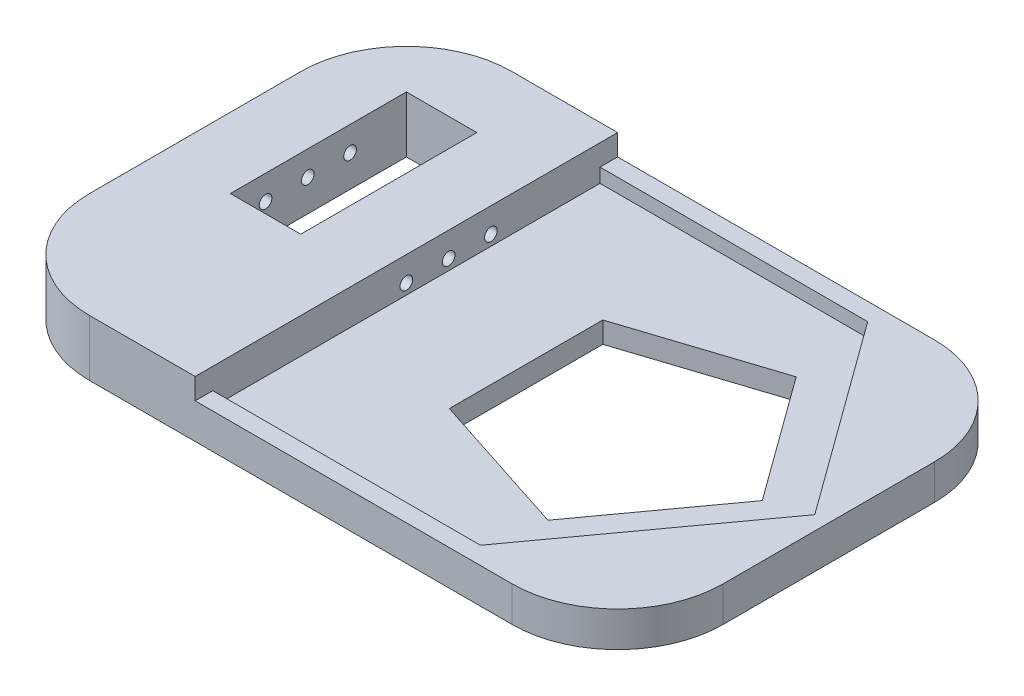
ISO-10303-21;
HEADER;
FILE_DESCRIPTION(('STEP AP214'),'2;1');
FILE_NAME('part.step','',(''),(''),'','','');
FILE_SCHEMA(('AUTOMOTIVE_DESIGN { 1 0 10303 214 1 1 1 1 }'));
ENDSEC;
DATA;
#1=APPLICATION_CONTEXT('core data for automotive mechanical design processes');
#2=APPLICATION_PROTOCOL_DEFINITION('international standard','automotive_design',2000,#1);
#3=PRODUCT_CONTEXT('',#1,'mechanical');
#4=PRODUCT('Part','Part','',(#3));
#5=PRODUCT_RELATED_PRODUCT_CATEGORY('part','',(#4));
#6=PRODUCT_DEFINITION_FORMATION('','',#4);
#7=PRODUCT_DEFINITION_CONTEXT('part definition',#1,'design');
#8=PRODUCT_DEFINITION('design','',#6,#7);
#9=PRODUCT_DEFINITION_SHAPE('','',#8);
#10=(LENGTH_UNIT() NAMED_UNIT(*) SI_UNIT(.MILLI.,.METRE.));
#11=(NAMED_UNIT(*) PLANE_ANGLE_UNIT() SI_UNIT($,.RADIAN.));
#12=(NAMED_UNIT(*) SI_UNIT($,.STERADIAN.) SOLID_ANGLE_UNIT());
#13=UNCERTAINTY_MEASURE_WITH_UNIT(LENGTH_MEASURE(1.E-05),#10,'distance_accuracy_value','');
#14=(GEOMETRIC_REPRESENTATION_CONTEXT(3) GLOBAL_UNCERTAINTY_ASSIGNED_CONTEXT((#13)) GLOBAL_UNIT_ASSIGNED_CONTEXT((#10,
#11,#12)) REPRESENTATION_CONTEXT('',''));
#15=CARTESIAN_POINT('',(0.,0.,0.));
#16=DIRECTION('',(0.,0.,1.));
#17=DIRECTION('',(1.,0.,0.));
#18=AXIS2_PLACEMENT_3D('',#15,#16,#17);
#19=CARTESIAN_POINT('',(45.,-3.,-30.));
#20=DIRECTION('',(1.,0.,0.));
#21=DIRECTION('',(0.,0.,-1.));
#22=AXIS2_PLACEMENT_3D('',#19,#20,#21);
#23=PLANE('',#22);
#24=DIRECTION('',(0.,0.,-1.));
#25=VECTOR('',#24,1.);
#26=CARTESIAN_POINT('',(45.,2.,-30.));
#27=LINE('',#26,#25);
#28=CARTESIAN_POINT('',(45.,2.,15.));
#29=VERTEX_POINT('',#28);
#30=CARTESIAN_POINT('',(45.,2.,-15.));
#31=VERTEX_POINT('',#30);
#32=EDGE_CURVE('E367',#29,#31,#27,.T.);
#33=ORIENTED_EDGE('',*,*,#32,.F.);
#34=DIRECTION('',(0.,1.,0.));
#35=VECTOR('',#34,1.);
#36=CARTESIAN_POINT('',(45.,-3.,15.));
#37=LINE('',#36,#35);
#38=CARTESIAN_POINT('',(45.,-3.,15.));
#39=VERTEX_POINT('',#38);
#40=EDGE_CURVE('E11',#29,#39,#37,.F.);
#41=ORIENTED_EDGE('',*,*,#40,.T.);
#42=DIRECTION('',(0.,0.,-1.));
#43=VECTOR('',#42,1.);
#44=CARTESIAN_POINT('',(45.,-3.,-30.));
#45=LINE('',#44,#43);
#46=CARTESIAN_POINT('',(45.,-3.,-15.));
#47=VERTEX_POINT('',#46);
#48=EDGE_CURVE('E366',#39,#47,#45,.T.);
#49=ORIENTED_EDGE('',*,*,#48,.T.);
#50=DIRECTION('',(0.,1.,0.));
#51=VECTOR('',#50,1.);
#52=CARTESIAN_POINT('',(45.,-3.,-15.));
#53=LINE('',#52,#51);
#54=EDGE_CURVE('E41',#47,#31,#53,.T.);
#55=ORIENTED_EDGE('',*,*,#54,.T.);
#56=EDGE_LOOP('',(#33,#41,#49,#55));
#57=FACE_BOUND('',#56,.T.);
#58=ADVANCED_FACE('F33',(#57),#23,.T.);
#59=CARTESIAN_POINT('',(-45.,-3.,30.));
#60=DIRECTION('',(0.,0.,1.));
#61=DIRECTION('',(1.,0.,0.));
#62=AXIS2_PLACEMENT_3D('',#59,#60,#61);
#63=PLANE('',#62);
#64=DIRECTION('',(1.,0.,0.));
#65=VECTOR('',#64,1.);
#66=CARTESIAN_POINT('',(-45.,5.,30.));
#67=LINE('',#66,#65);
#68=CARTESIAN_POINT('',(-30.,5.,30.));
#69=VERTEX_POINT('',#68);
#70=CARTESIAN_POINT('',(-15.,5.,30.));
#71=VERTEX_POINT('',#70);
#72=EDGE_CURVE('E305',#69,#71,#67,.T.);
#73=ORIENTED_EDGE('',*,*,#72,.F.);
#74=DIRECTION('',(0.,1.,0.));
#75=VECTOR('',#74,1.);
#76=CARTESIAN_POINT('',(-30.,-3.,30.));
#77=LINE('',#76,#75);
#78=CARTESIAN_POINT('',(-30.,-3.,30.));
#79=VERTEX_POINT('',#78);
#80=EDGE_CURVE('E390',#69,#79,#77,.F.);
#81=ORIENTED_EDGE('',*,*,#80,.T.);
#82=DIRECTION('',(1.,0.,0.));
#83=VECTOR('',#82,1.);
#84=CARTESIAN_POINT('',(-45.,-3.,30.));
#85=LINE('',#84,#83);
#86=CARTESIAN_POINT('',(29.9999999999999,-3.,30.));
#87=VERTEX_POINT('',#86);
#88=EDGE_CURVE('E323',#79,#87,#85,.T.);
#89=ORIENTED_EDGE('',*,*,#88,.T.);
#90=DIRECTION('',(0.,1.,0.));
#91=VECTOR('',#90,1.);
#92=CARTESIAN_POINT('',(30.,-3.,30.));
#93=LINE('',#92,#91);
#94=CARTESIAN_POINT('',(30.,2.,30.));
#95=VERTEX_POINT('',#94);
#96=EDGE_CURVE('E387',#87,#95,#93,.T.);
#97=ORIENTED_EDGE('',*,*,#96,.T.);
#98=DIRECTION('',(1.,0.,0.));
#99=VECTOR('',#98,1.);
#100=CARTESIAN_POINT('',(45.,2.,30.));
#101=LINE('',#100,#99);
#102=CARTESIAN_POINT('',(-15.,2.,30.));
#103=VERTEX_POINT('',#102);
#104=EDGE_CURVE('E324',#103,#95,#101,.T.);
#105=ORIENTED_EDGE('',*,*,#104,.F.);
#106=DIRECTION('',(0.,-1.,0.));
#107=VECTOR('',#106,1.);
#108=CARTESIAN_POINT('',(-15.,5.,30.));
#109=LINE('',#108,#107);
#110=EDGE_CURVE('E329',#71,#103,#109,.T.);
#111=ORIENTED_EDGE('',*,*,#110,.F.);
#112=EDGE_LOOP('',(#73,#81,#89,#97,#105,#111));
#113=FACE_BOUND('',#112,.T.);
#114=ADVANCED_FACE('F385',(#113),#63,.T.);
#115=CARTESIAN_POINT('',(-45.,-3.,-30.));
#116=DIRECTION('',(-1.,0.,0.));
#117=DIRECTION('',(0.,0.,1.));
#118=AXIS2_PLACEMENT_3D('',#115,#116,#117);
#119=PLANE('',#118);
#120=DIRECTION('',(0.,0.,1.));
#121=VECTOR('',#120,1.);
#122=CARTESIAN_POINT('',(-45.,5.,-30.));
#123=LINE('',#122,#121);
#124=CARTESIAN_POINT('',(-45.,5.,-15.));
#125=VERTEX_POINT('',#124);
#126=CARTESIAN_POINT('',(-45.,5.,15.));
#127=VERTEX_POINT('',#126);
#128=EDGE_CURVE('E302',#125,#127,#123,.T.);
#129=ORIENTED_EDGE('',*,*,#128,.F.);
#130=DIRECTION('',(0.,1.,0.));
#131=VECTOR('',#130,1.);
#132=CARTESIAN_POINT('',(-45.,-3.,-15.));
#133=LINE('',#132,#131);
#134=CARTESIAN_POINT('',(-45.,-3.,-15.));
#135=VERTEX_POINT('',#134);
#136=EDGE_CURVE('E479',#125,#135,#133,.F.);
#137=ORIENTED_EDGE('',*,*,#136,.T.);
#138=DIRECTION('',(0.,0.,1.));
#139=VECTOR('',#138,1.);
#140=CARTESIAN_POINT('',(-45.,-3.,-30.));
#141=LINE('',#140,#139);
#142=CARTESIAN_POINT('',(-45.,-3.,15.));
#143=VERTEX_POINT('',#142);
#144=EDGE_CURVE('E377',#135,#143,#141,.T.);
#145=ORIENTED_EDGE('',*,*,#144,.T.);
#146=DIRECTION('',(0.,1.,0.));
#147=VECTOR('',#146,1.);
#148=CARTESIAN_POINT('',(-45.,-3.,15.));
#149=LINE('',#148,#147);
#150=EDGE_CURVE('E473',#143,#127,#149,.T.);
#151=ORIENTED_EDGE('',*,*,#150,.T.);
#152=EDGE_LOOP('',(#129,#137,#145,#151));
#153=FACE_BOUND('',#152,.T.);
#154=ADVANCED_FACE('F505',(#153),#119,.T.);
#155=CARTESIAN_POINT('',(-45.,-3.,-30.));
#156=DIRECTION('',(0.,0.,-1.));
#157=DIRECTION('',(-1.,0.,0.));
#158=AXIS2_PLACEMENT_3D('',#155,#156,#157);
#159=PLANE('',#158);
#160=DIRECTION('',(-1.,0.,0.));
#161=VECTOR('',#160,1.);
#162=CARTESIAN_POINT('',(-45.,-3.,-30.));
#163=LINE('',#162,#161);
#164=CARTESIAN_POINT('',(29.9999999999999,-3.,-30.));
#165=VERTEX_POINT('',#164);
#166=CARTESIAN_POINT('',(-30.,-3.,-30.));
#167=VERTEX_POINT('',#166);
#168=EDGE_CURVE('E374',#165,#167,#163,.T.);
#169=ORIENTED_EDGE('',*,*,#168,.T.);
#170=DIRECTION('',(0.,1.,0.));
#171=VECTOR('',#170,1.);
#172=CARTESIAN_POINT('',(-30.,-3.,-30.));
#173=LINE('',#172,#171);
#174=CARTESIAN_POINT('',(-30.,5.,-30.));
#175=VERTEX_POINT('',#174);
#176=EDGE_CURVE('E484',#167,#175,#173,.T.);
#177=ORIENTED_EDGE('',*,*,#176,.T.);
#178=DIRECTION('',(-1.,0.,0.));
#179=VECTOR('',#178,1.);
#180=CARTESIAN_POINT('',(-45.,5.,-30.));
#181=LINE('',#180,#179);
#182=CARTESIAN_POINT('',(-15.,5.,-30.));
#183=VERTEX_POINT('',#182);
#184=EDGE_CURVE('E309',#183,#175,#181,.T.);
#185=ORIENTED_EDGE('',*,*,#184,.F.);
#186=DIRECTION('',(0.,-1.,0.));
#187=VECTOR('',#186,1.);
#188=CARTESIAN_POINT('',(-15.,5.,-30.));
#189=LINE('',#188,#187);
#190=CARTESIAN_POINT('',(-15.,2.,-30.));
#191=VERTEX_POINT('',#190);
#192=EDGE_CURVE('E312',#183,#191,#189,.T.);
#193=ORIENTED_EDGE('',*,*,#192,.T.);
#194=DIRECTION('',(-1.,0.,0.));
#195=VECTOR('',#194,1.);
#196=CARTESIAN_POINT('',(45.,2.,-30.));
#197=LINE('',#196,#195);
#198=CARTESIAN_POINT('',(30.,2.,-30.));
#199=VERTEX_POINT('',#198);
#200=EDGE_CURVE('E363',#199,#191,#197,.T.);
#201=ORIENTED_EDGE('',*,*,#200,.F.);
#202=DIRECTION('',(0.,1.,0.));
#203=VECTOR('',#202,1.);
#204=CARTESIAN_POINT('',(30.,-3.,-30.));
#205=LINE('',#204,#203);
#206=EDGE_CURVE('E322',#199,#165,#205,.F.);
#207=ORIENTED_EDGE('',*,*,#206,.T.);
#208=EDGE_LOOP('',(#169,#177,#185,#193,#201,#207));
#209=FACE_BOUND('',#208,.T.);
#210=ADVANCED_FACE('F491',(#209),#159,.T.);
#211=CARTESIAN_POINT('',(0.,-3.,0.));
#212=DIRECTION('',(0.,1.,0.));
#213=DIRECTION('',(0.,0.,1.));
#214=AXIS2_PLACEMENT_3D('',#211,#212,#213);
#215=PLANE('',#214);
#216=DIRECTION('',(0.951056516295154,0.,0.309016994374948));
#217=VECTOR('',#216,1.);
#218=CARTESIAN_POINT('',(1.99999999999992,-3.,10.8981379200804));
#219=LINE('',#218,#217);
#220=CARTESIAN_POINT('',(1.99999999999992,-3.,10.8981379200804));
#221=VERTEX_POINT('',#220);
#222=CARTESIAN_POINT('',(22.7294901687515,-3.,17.6335575687742));
#223=VERTEX_POINT('',#222);
#224=EDGE_CURVE('E201',#221,#223,#219,.T.);
#225=ORIENTED_EDGE('',*,*,#224,.T.);
#226=DIRECTION('',(0.587785252292473,0.,-0.809016994374947));
#227=VECTOR('',#226,1.);
#228=CARTESIAN_POINT('',(22.7294901687515,-3.,17.6335575687742));
#229=LINE('',#228,#227);
#230=CARTESIAN_POINT('',(35.5410196624968,-3.,0.));
#231=VERTEX_POINT('',#230);
#232=EDGE_CURVE('E195',#223,#231,#229,.T.);
#233=ORIENTED_EDGE('',*,*,#232,.T.);
#234=DIRECTION('',(-0.587785252292473,0.,-0.809016994374948));
#235=VECTOR('',#234,1.);
#236=CARTESIAN_POINT('',(35.5410196624968,-3.,0.));
#237=LINE('',#236,#235);
#238=CARTESIAN_POINT('',(22.7294901687515,-3.,-17.6335575687742));
#239=VERTEX_POINT('',#238);
#240=EDGE_CURVE('E204',#231,#239,#237,.T.);
#241=ORIENTED_EDGE('',*,*,#240,.T.);
#242=DIRECTION('',(-0.951056516295154,0.,0.309016994374947));
#243=VECTOR('',#242,1.);
#244=CARTESIAN_POINT('',(22.7294901687515,-3.,-17.6335575687742));
#245=LINE('',#244,#243);
#246=CARTESIAN_POINT('',(1.99999999999992,-3.,-10.8981379200804));
#247=VERTEX_POINT('',#246);
#248=EDGE_CURVE('E48',#239,#247,#245,.T.);
#249=ORIENTED_EDGE('',*,*,#248,.T.);
#250=DIRECTION('',(0.,0.,1.));
#251=VECTOR('',#250,1.);
#252=CARTESIAN_POINT('',(1.99999999999992,-3.,-10.8981379200804));
#253=LINE('',#252,#251);
#254=EDGE_CURVE('E219',#247,#221,#253,.T.);
#255=ORIENTED_EDGE('',*,*,#254,.T.);
#256=EDGE_LOOP('',(#225,#233,#241,#249,#255));
#257=FACE_BOUND('',#256,.T.);
#258=DIRECTION('',(-1.,0.,0.));
#259=VECTOR('',#258,1.);
#260=CARTESIAN_POINT('',(-35.,-3.,-20.));
#261=LINE('',#260,#259);
#262=CARTESIAN_POINT('',(-25.,-3.,-20.));
#263=VERTEX_POINT('',#262);
#264=CARTESIAN_POINT('',(-35.,-3.,-20.));
#265=VERTEX_POINT('',#264);
#266=EDGE_CURVE('E248',#263,#265,#261,.T.);
#267=ORIENTED_EDGE('',*,*,#266,.T.);
#268=DIRECTION('',(0.,0.,1.));
#269=VECTOR('',#268,1.);
#270=CARTESIAN_POINT('',(-35.,-3.,-20.));
#271=LINE('',#270,#269);
#272=CARTESIAN_POINT('',(-35.,-3.,5.));
#273=VERTEX_POINT('',#272);
#274=EDGE_CURVE('E238',#265,#273,#271,.T.);
#275=ORIENTED_EDGE('',*,*,#274,.T.);
#276=DIRECTION('',(1.,0.,0.));
#277=VECTOR('',#276,1.);
#278=CARTESIAN_POINT('',(-35.,-3.,5.));
#279=LINE('',#278,#277);
#280=CARTESIAN_POINT('',(-25.,-3.,5.));
#281=VERTEX_POINT('',#280);
#282=EDGE_CURVE('E241',#273,#281,#279,.T.);
#283=ORIENTED_EDGE('',*,*,#282,.T.);
#284=DIRECTION('',(0.,0.,-1.));
#285=VECTOR('',#284,1.);
#286=CARTESIAN_POINT('',(-25.,-3.,-20.));
#287=LINE('',#286,#285);
#288=EDGE_CURVE('E245',#281,#263,#287,.T.);
#289=ORIENTED_EDGE('',*,*,#288,.T.);
#290=EDGE_LOOP('',(#267,#275,#283,#289));
#291=FACE_BOUND('',#290,.T.);
#292=ORIENTED_EDGE('',*,*,#144,.F.);
#293=CARTESIAN_POINT('',(-30.,-3.,-15.));
#294=DIRECTION('',(0.,1.,0.));
#295=DIRECTION('',(0.,0.,1.));
#296=AXIS2_PLACEMENT_3D('',#293,#294,#295);
#297=CIRCLE('',#296,15.);
#298=EDGE_CURVE('E399',#135,#167,#297,.F.);
#299=ORIENTED_EDGE('',*,*,#298,.T.);
#300=ORIENTED_EDGE('',*,*,#168,.F.);
#301=CARTESIAN_POINT('',(30.,-3.,-15.));
#302=DIRECTION('',(0.,1.,0.));
#303=DIRECTION('',(0.,0.,1.));
#304=AXIS2_PLACEMENT_3D('',#301,#302,#303);
#305=CIRCLE('',#304,15.);
#306=EDGE_CURVE('E475',#165,#47,#305,.F.);
#307=ORIENTED_EDGE('',*,*,#306,.T.);
#308=ORIENTED_EDGE('',*,*,#48,.F.);
#309=CARTESIAN_POINT('',(30.,-3.,15.));
#310=DIRECTION('',(0.,1.,0.));
#311=DIRECTION('',(0.,0.,1.));
#312=AXIS2_PLACEMENT_3D('',#309,#310,#311);
#313=CIRCLE('',#312,15.);
#314=EDGE_CURVE('E397',#39,#87,#313,.F.);
#315=ORIENTED_EDGE('',*,*,#314,.T.);
#316=ORIENTED_EDGE('',*,*,#88,.F.);
#317=CARTESIAN_POINT('',(-30.,-3.,15.));
#318=DIRECTION('',(0.,1.,0.));
#319=DIRECTION('',(0.,0.,1.));
#320=AXIS2_PLACEMENT_3D('',#317,#318,#319);
#321=CIRCLE('',#320,15.);
#322=EDGE_CURVE('E403',#79,#143,#321,.F.);
#323=ORIENTED_EDGE('',*,*,#322,.T.);
#324=EDGE_LOOP('',(#292,#299,#300,#307,#308,#315,#316,#323));
#325=FACE_BOUND('',#324,.T.);
#326=ADVANCED_FACE('F208',(#257,#291,#325),#215,.F.);
#327=CARTESIAN_POINT('',(0.,2.,0.));
#328=DIRECTION('',(0.,1.,0.));
#329=DIRECTION('',(0.,0.,1.));
#330=AXIS2_PLACEMENT_3D('',#327,#328,#329);
#331=PLANE('',#330);
#332=ORIENTED_EDGE('',*,*,#104,.T.);
#333=CARTESIAN_POINT('',(30.,2.,15.));
#334=DIRECTION('',(0.,1.,0.));
#335=DIRECTION('',(0.,0.,1.));
#336=AXIS2_PLACEMENT_3D('',#333,#334,#335);
#337=CIRCLE('',#336,15.);
#338=EDGE_CURVE('E398',#95,#29,#337,.T.);
#339=ORIENTED_EDGE('',*,*,#338,.T.);
#340=ORIENTED_EDGE('',*,*,#32,.T.);
#341=CARTESIAN_POINT('',(30.,2.,-15.));
#342=DIRECTION('',(0.,1.,0.));
#343=DIRECTION('',(0.,0.,1.));
#344=AXIS2_PLACEMENT_3D('',#341,#342,#343);
#345=CIRCLE('',#344,15.);
#346=EDGE_CURVE('E401',#31,#199,#345,.T.);
#347=ORIENTED_EDGE('',*,*,#346,.T.);
#348=ORIENTED_EDGE('',*,*,#200,.T.);
#349=DIRECTION('',(0.,0.,-1.));
#350=VECTOR('',#349,1.);
#351=CARTESIAN_POINT('',(-15.,2.,-30.));
#352=LINE('',#351,#350);
#353=CARTESIAN_POINT('',(-15.,2.,-27.5));
#354=VERTEX_POINT('',#353);
#355=EDGE_CURVE('E318',#354,#191,#352,.T.);
#356=ORIENTED_EDGE('',*,*,#355,.F.);
#357=DIRECTION('',(-1.,0.,0.));
#358=VECTOR('',#357,1.);
#359=CARTESIAN_POINT('',(23.0200804798526,2.,-27.5));
#360=LINE('',#359,#358);
#361=CARTESIAN_POINT('',(23.0200804798526,2.,-27.5));
#362=VERTEX_POINT('',#361);
#363=EDGE_CURVE('E332',#362,#354,#360,.T.);
#364=ORIENTED_EDGE('',*,*,#363,.F.);
#365=DIRECTION('',(-0.587785252292471,0.,-0.809016994374949));
#366=VECTOR('',#365,1.);
#367=CARTESIAN_POINT('',(43.,2.,0.));
#368=LINE('',#367,#366);
#369=CARTESIAN_POINT('',(43.,2.,0.));
#370=VERTEX_POINT('',#369);
#371=EDGE_CURVE('E336',#370,#362,#368,.T.);
#372=ORIENTED_EDGE('',*,*,#371,.F.);
#373=DIRECTION('',(0.587785252292471,0.,-0.809016994374949));
#374=VECTOR('',#373,1.);
#375=CARTESIAN_POINT('',(43.,2.,0.));
#376=LINE('',#375,#374);
#377=CARTESIAN_POINT('',(23.0200804798526,2.,27.5));
#378=VERTEX_POINT('',#377);
#379=EDGE_CURVE('E433',#378,#370,#376,.T.);
#380=ORIENTED_EDGE('',*,*,#379,.F.);
#381=DIRECTION('',(1.,0.,0.));
#382=VECTOR('',#381,1.);
#383=CARTESIAN_POINT('',(23.0200804798526,2.,27.5));
#384=LINE('',#383,#382);
#385=CARTESIAN_POINT('',(-15.,2.,27.5));
#386=VERTEX_POINT('',#385);
#387=EDGE_CURVE('E335',#386,#378,#384,.T.);
#388=ORIENTED_EDGE('',*,*,#387,.F.);
#389=EDGE_CURVE('E299',#103,#386,#352,.T.);
#390=ORIENTED_EDGE('',*,*,#389,.F.);
#391=EDGE_LOOP('',(#332,#339,#340,#347,#348,#356,#364,#372,#380,#388,#390));
#392=FACE_BOUND('',#391,.T.);
#393=ADVANCED_FACE('F417',(#392),#331,.T.);
#394=CARTESIAN_POINT('',(43.,2.,0.));
#395=DIRECTION('',(-0.809016994374949,0.,-0.587785252292471));
#396=DIRECTION('',(-0.587785252292471,0.,0.809016994374949));
#397=AXIS2_PLACEMENT_3D('',#394,#395,#396);
#398=PLANE('',#397);
#399=DIRECTION('',(0.587785252292471,0.,-0.809016994374949));
#400=VECTOR('',#399,1.);
#401=CARTESIAN_POINT('',(43.,0.,0.));
#402=LINE('',#401,#400);
#403=CARTESIAN_POINT('',(23.0200804798526,0.,27.5));
#404=VERTEX_POINT('',#403);
#405=CARTESIAN_POINT('',(42.9999999999999,0.,0.));
#406=VERTEX_POINT('',#405);
#407=EDGE_CURVE('E356',#404,#406,#402,.T.);
#408=ORIENTED_EDGE('',*,*,#407,.F.);
#409=DIRECTION('',(0.,-1.,0.));
#410=VECTOR('',#409,1.);
#411=CARTESIAN_POINT('',(23.0200804798526,2.,27.5));
#412=LINE('',#411,#410);
#413=EDGE_CURVE('E348',#378,#404,#412,.T.);
#414=ORIENTED_EDGE('',*,*,#413,.F.);
#415=ORIENTED_EDGE('',*,*,#379,.T.);
#416=DIRECTION('',(0.,-1.,0.));
#417=VECTOR('',#416,1.);
#418=CARTESIAN_POINT('',(43.,2.,0.));
#419=LINE('',#418,#417);
#420=EDGE_CURVE('E419',#370,#406,#419,.T.);
#421=ORIENTED_EDGE('',*,*,#420,.T.);
#422=EDGE_LOOP('',(#408,#414,#415,#421));
#423=FACE_BOUND('',#422,.T.);
#424=ADVANCED_FACE('F443',(#423),#398,.T.);
#425=CARTESIAN_POINT('',(43.,2.,0.));
#426=DIRECTION('',(-0.809016994374949,0.,0.587785252292471));
#427=DIRECTION('',(0.587785252292471,0.,0.809016994374949));
#428=AXIS2_PLACEMENT_3D('',#425,#426,#427);
#429=PLANE('',#428);
#430=DIRECTION('',(-0.587785252292471,0.,-0.809016994374949));
#431=VECTOR('',#430,1.);
#432=CARTESIAN_POINT('',(43.,0.,0.));
#433=LINE('',#432,#431);
#434=CARTESIAN_POINT('',(23.0200804798526,0.,-27.5));
#435=VERTEX_POINT('',#434);
#436=EDGE_CURVE('E438',#406,#435,#433,.T.);
#437=ORIENTED_EDGE('',*,*,#436,.F.);
#438=ORIENTED_EDGE('',*,*,#420,.F.);
#439=ORIENTED_EDGE('',*,*,#371,.T.);
#440=DIRECTION('',(0.,-1.,0.));
#441=VECTOR('',#440,1.);
#442=CARTESIAN_POINT('',(23.0200804798526,2.,-27.5));
#443=LINE('',#442,#441);
#444=EDGE_CURVE('E342',#362,#435,#443,.T.);
#445=ORIENTED_EDGE('',*,*,#444,.T.);
#446=EDGE_LOOP('',(#437,#438,#439,#445));
#447=FACE_BOUND('',#446,.T.);
#448=ADVANCED_FACE('F448',(#447),#429,.T.);
#449=CARTESIAN_POINT('',(23.0200804798526,2.,-27.5));
#450=DIRECTION('',(0.,0.,1.));
#451=DIRECTION('',(1.,0.,0.));
#452=AXIS2_PLACEMENT_3D('',#449,#450,#451);
#453=PLANE('',#452);
#454=DIRECTION('',(-1.,0.,0.));
#455=VECTOR('',#454,1.);
#456=CARTESIAN_POINT('',(23.0200804798526,0.,-27.5));
#457=LINE('',#456,#455);
#458=CARTESIAN_POINT('',(-15.,0.,-27.5));
#459=VERTEX_POINT('',#458);
#460=EDGE_CURVE('E436',#435,#459,#457,.T.);
#461=ORIENTED_EDGE('',*,*,#460,.F.);
#462=ORIENTED_EDGE('',*,*,#444,.F.);
#463=ORIENTED_EDGE('',*,*,#363,.T.);
#464=DIRECTION('',(0.,-1.,0.));
#465=VECTOR('',#464,1.);
#466=CARTESIAN_POINT('',(-15.,2.,-27.5));
#467=LINE('',#466,#465);
#468=EDGE_CURVE('E339',#354,#459,#467,.T.);
#469=ORIENTED_EDGE('',*,*,#468,.T.);
#470=EDGE_LOOP('',(#461,#462,#463,#469));
#471=FACE_BOUND('',#470,.T.);
#472=ADVANCED_FACE('F454',(#471),#453,.T.);
#473=CARTESIAN_POINT('',(-15.,2.,-27.5));
#474=DIRECTION('',(1.,0.,0.));
#475=DIRECTION('',(0.,0.,-1.));
#476=AXIS2_PLACEMENT_3D('',#473,#474,#475);
#477=PLANE('',#476);
#478=CARTESIAN_POINT('',(-15.,1.49999999999999,-12.));
#479=DIRECTION('',(1.,0.,0.));
#480=DIRECTION('',(0.,0.,-1.));
#481=AXIS2_PLACEMENT_3D('',#478,#479,#480);
#482=CIRCLE('',#481,0.9);
#483=CARTESIAN_POINT('',(-15.,1.49999999999999,-12.9));
#484=VERTEX_POINT('',#483);
#485=EDGE_CURVE('E283',#484,#484,#482,.T.);
#486=ORIENTED_EDGE('',*,*,#485,.F.);
#487=EDGE_LOOP('',(#486));
#488=FACE_BOUND('',#487,.T.);
#489=CARTESIAN_POINT('',(-15.,1.49999999999999,-6.));
#490=DIRECTION('',(1.,0.,0.));
#491=DIRECTION('',(0.,0.,-1.));
#492=AXIS2_PLACEMENT_3D('',#489,#490,#491);
#493=CIRCLE('',#492,0.9);
#494=CARTESIAN_POINT('',(-15.,1.49999999999999,-6.9));
#495=VERTEX_POINT('',#494);
#496=EDGE_CURVE('E287',#495,#495,#493,.T.);
#497=ORIENTED_EDGE('',*,*,#496,.F.);
#498=EDGE_LOOP('',(#497));
#499=FACE_BOUND('',#498,.T.);
#500=CARTESIAN_POINT('',(-15.,1.49999999999999,0.));
#501=DIRECTION('',(1.,0.,0.));
#502=DIRECTION('',(0.,0.,-1.));
#503=AXIS2_PLACEMENT_3D('',#500,#501,#502);
#504=CIRCLE('',#503,0.9);
#505=CARTESIAN_POINT('',(-15.,1.49999999999999,-0.899999999999998));
#506=VERTEX_POINT('',#505);
#507=EDGE_CURVE('E293',#506,#506,#504,.T.);
#508=ORIENTED_EDGE('',*,*,#507,.F.);
#509=EDGE_LOOP('',(#508));
#510=FACE_BOUND('',#509,.T.);
#511=DIRECTION('',(0.,0.,1.));
#512=VECTOR('',#511,1.);
#513=CARTESIAN_POINT('',(-15.,0.,-27.5));
#514=LINE('',#513,#512);
#515=CARTESIAN_POINT('',(-15.,0.,27.5));
#516=VERTEX_POINT('',#515);
#517=EDGE_CURVE('E434',#459,#516,#514,.T.);
#518=ORIENTED_EDGE('',*,*,#517,.F.);
#519=ORIENTED_EDGE('',*,*,#468,.F.);
#520=ORIENTED_EDGE('',*,*,#355,.T.);
#521=ORIENTED_EDGE('',*,*,#192,.F.);
#522=DIRECTION('',(0.,0.,-1.));
#523=VECTOR('',#522,1.);
#524=CARTESIAN_POINT('',(-15.,5.,-30.));
#525=LINE('',#524,#523);
#526=EDGE_CURVE('E307',#71,#183,#525,.T.);
#527=ORIENTED_EDGE('',*,*,#526,.F.);
#528=ORIENTED_EDGE('',*,*,#110,.T.);
#529=ORIENTED_EDGE('',*,*,#389,.T.);
#530=DIRECTION('',(0.,-1.,0.));
#531=VECTOR('',#530,1.);
#532=CARTESIAN_POINT('',(-15.,2.,27.5));
#533=LINE('',#532,#531);
#534=EDGE_CURVE('E343',#386,#516,#533,.T.);
#535=ORIENTED_EDGE('',*,*,#534,.T.);
#536=EDGE_LOOP('',(#518,#519,#520,#521,#527,#528,#529,#535));
#537=FACE_BOUND('',#536,.T.);
#538=ADVANCED_FACE('F457',(#488,#499,#510,#537),#477,.T.);
#539=CARTESIAN_POINT('',(23.0200804798526,2.,27.5));
#540=DIRECTION('',(0.,0.,-1.));
#541=DIRECTION('',(-1.,0.,0.));
#542=AXIS2_PLACEMENT_3D('',#539,#540,#541);
#543=PLANE('',#542);
#544=DIRECTION('',(1.,0.,0.));
#545=VECTOR('',#544,1.);
#546=CARTESIAN_POINT('',(23.0200804798526,0.,27.5));
#547=LINE('',#546,#545);
#548=EDGE_CURVE('E431',#516,#404,#547,.T.);
#549=ORIENTED_EDGE('',*,*,#548,.F.);
#550=ORIENTED_EDGE('',*,*,#534,.F.);
#551=ORIENTED_EDGE('',*,*,#387,.T.);
#552=ORIENTED_EDGE('',*,*,#413,.T.);
#553=EDGE_LOOP('',(#549,#550,#551,#552));
#554=FACE_BOUND('',#553,.T.);
#555=ADVANCED_FACE('F464',(#554),#543,.T.);
#556=CARTESIAN_POINT('',(0.,0.,0.));
#557=DIRECTION('',(0.,1.,0.));
#558=DIRECTION('',(0.,0.,1.));
#559=AXIS2_PLACEMENT_3D('',#556,#557,#558);
#560=PLANE('',#559);
#561=DIRECTION('',(0.587785252292473,0.,-0.809016994374947));
#562=VECTOR('',#561,1.);
#563=CARTESIAN_POINT('',(22.7294901687515,0.,17.6335575687742));
#564=LINE('',#563,#562);
#565=CARTESIAN_POINT('',(22.7294901687515,0.,17.6335575687742));
#566=VERTEX_POINT('',#565);
#567=CARTESIAN_POINT('',(35.5410196624968,0.,0.));
#568=VERTEX_POINT('',#567);
#569=EDGE_CURVE('E56',#566,#568,#564,.T.);
#570=ORIENTED_EDGE('',*,*,#569,.F.);
#571=DIRECTION('',(0.951056516295154,0.,0.309016994374948));
#572=VECTOR('',#571,1.);
#573=CARTESIAN_POINT('',(1.99999999999992,0.,10.8981379200804));
#574=LINE('',#573,#572);
#575=CARTESIAN_POINT('',(1.99999999999992,0.,10.8981379200804));
#576=VERTEX_POINT('',#575);
#577=EDGE_CURVE('E212',#576,#566,#574,.T.);
#578=ORIENTED_EDGE('',*,*,#577,.F.);
#579=DIRECTION('',(0.,0.,1.));
#580=VECTOR('',#579,1.);
#581=CARTESIAN_POINT('',(1.99999999999992,0.,-10.8981379200804));
#582=LINE('',#581,#580);
#583=CARTESIAN_POINT('',(1.99999999999992,0.,-10.8981379200804));
#584=VERTEX_POINT('',#583);
#585=EDGE_CURVE('E215',#584,#576,#582,.T.);
#586=ORIENTED_EDGE('',*,*,#585,.F.);
#587=DIRECTION('',(-0.951056516295154,0.,0.309016994374947));
#588=VECTOR('',#587,1.);
#589=CARTESIAN_POINT('',(22.7294901687515,0.,-17.6335575687742));
#590=LINE('',#589,#588);
#591=CARTESIAN_POINT('',(22.7294901687515,0.,-17.6335575687742));
#592=VERTEX_POINT('',#591);
#593=EDGE_CURVE('E225',#592,#584,#590,.T.);
#594=ORIENTED_EDGE('',*,*,#593,.F.);
#595=DIRECTION('',(-0.587785252292473,0.,-0.809016994374948));
#596=VECTOR('',#595,1.);
#597=CARTESIAN_POINT('',(35.5410196624968,0.,0.));
#598=LINE('',#597,#596);
#599=EDGE_CURVE('E223',#568,#592,#598,.T.);
#600=ORIENTED_EDGE('',*,*,#599,.F.);
#601=EDGE_LOOP('',(#570,#578,#586,#594,#600));
#602=FACE_BOUND('',#601,.T.);
#603=ORIENTED_EDGE('',*,*,#407,.T.);
#604=ORIENTED_EDGE('',*,*,#436,.T.);
#605=ORIENTED_EDGE('',*,*,#460,.T.);
#606=ORIENTED_EDGE('',*,*,#517,.T.);
#607=ORIENTED_EDGE('',*,*,#548,.T.);
#608=EDGE_LOOP('',(#603,#604,#605,#606,#607));
#609=FACE_BOUND('',#608,.T.);
#610=ADVANCED_FACE('F462',(#602,#609),#560,.T.);
#611=CARTESIAN_POINT('',(0.,5.,0.));
#612=DIRECTION('',(0.,1.,0.));
#613=DIRECTION('',(0.,0.,1.));
#614=AXIS2_PLACEMENT_3D('',#611,#612,#613);
#615=PLANE('',#614);
#616=DIRECTION('',(0.,0.,1.));
#617=VECTOR('',#616,1.);
#618=CARTESIAN_POINT('',(-35.,5.,-20.));
#619=LINE('',#618,#617);
#620=CARTESIAN_POINT('',(-35.,5.,-20.));
#621=VERTEX_POINT('',#620);
#622=CARTESIAN_POINT('',(-35.,5.,5.));
#623=VERTEX_POINT('',#622);
#624=EDGE_CURVE('E232',#621,#623,#619,.T.);
#625=ORIENTED_EDGE('',*,*,#624,.F.);
#626=DIRECTION('',(-1.,0.,0.));
#627=VECTOR('',#626,1.);
#628=CARTESIAN_POINT('',(-35.,5.,-20.));
#629=LINE('',#628,#627);
#630=CARTESIAN_POINT('',(-25.,5.,-20.));
#631=VERTEX_POINT('',#630);
#632=EDGE_CURVE('E242',#631,#621,#629,.T.);
#633=ORIENTED_EDGE('',*,*,#632,.F.);
#634=DIRECTION('',(0.,0.,-1.));
#635=VECTOR('',#634,1.);
#636=CARTESIAN_POINT('',(-25.,5.,-20.));
#637=LINE('',#636,#635);
#638=CARTESIAN_POINT('',(-25.,5.,5.));
#639=VERTEX_POINT('',#638);
#640=EDGE_CURVE('E256',#639,#631,#637,.T.);
#641=ORIENTED_EDGE('',*,*,#640,.F.);
#642=DIRECTION('',(1.,0.,0.));
#643=VECTOR('',#642,1.);
#644=CARTESIAN_POINT('',(-35.,5.,5.));
#645=LINE('',#644,#643);
#646=EDGE_CURVE('E253',#623,#639,#645,.T.);
#647=ORIENTED_EDGE('',*,*,#646,.F.);
#648=EDGE_LOOP('',(#625,#633,#641,#647));
#649=FACE_BOUND('',#648,.T.);
#650=ORIENTED_EDGE('',*,*,#184,.T.);
#651=CARTESIAN_POINT('',(-30.,5.,-15.));
#652=DIRECTION('',(0.,1.,0.));
#653=DIRECTION('',(0.,0.,1.));
#654=AXIS2_PLACEMENT_3D('',#651,#652,#653);
#655=CIRCLE('',#654,15.);
#656=EDGE_CURVE('E482',#175,#125,#655,.T.);
#657=ORIENTED_EDGE('',*,*,#656,.T.);
#658=ORIENTED_EDGE('',*,*,#128,.T.);
#659=CARTESIAN_POINT('',(-30.,5.,15.));
#660=DIRECTION('',(0.,1.,0.));
#661=DIRECTION('',(0.,0.,1.));
#662=AXIS2_PLACEMENT_3D('',#659,#660,#661);
#663=CIRCLE('',#662,15.);
#664=EDGE_CURVE('E471',#127,#69,#663,.T.);
#665=ORIENTED_EDGE('',*,*,#664,.T.);
#666=ORIENTED_EDGE('',*,*,#72,.T.);
#667=ORIENTED_EDGE('',*,*,#526,.T.);
#668=EDGE_LOOP('',(#650,#657,#658,#665,#666,#667));
#669=FACE_BOUND('',#668,.T.);
#670=ADVANCED_FACE('F550',(#649,#669),#615,.T.);
#671=CARTESIAN_POINT('',(-37.,1.49999999999999,0.));
#672=DIRECTION('',(1.,0.,0.));
#673=DIRECTION('',(0.,0.,-1.));
#674=AXIS2_PLACEMENT_3D('',#671,#672,#673);
#675=CYLINDRICAL_SURFACE('',#674,0.9);
#676=CARTESIAN_POINT('',(-25.,1.49999999999999,0.));
#677=DIRECTION('',(1.,0.,0.));
#678=DIRECTION('',(0.,0.,-1.));
#679=AXIS2_PLACEMENT_3D('',#676,#677,#678);
#680=CIRCLE('',#679,0.9);
#681=CARTESIAN_POINT('',(-25.,1.49999999999999,-0.899999999999997));
#682=VERTEX_POINT('',#681);
#683=EDGE_CURVE('E273',#682,#682,#680,.F.);
#684=ORIENTED_EDGE('',*,*,#683,.T.);
#685=EDGE_LOOP('',(#684));
#686=FACE_BOUND('',#685,.T.);
#687=ORIENTED_EDGE('',*,*,#507,.T.);
#688=EDGE_LOOP('',(#687));
#689=FACE_BOUND('',#688,.T.);
#690=ADVANCED_FACE('F633',(#686,#689),#675,.F.);
#691=CARTESIAN_POINT('',(-37.,1.49999999999999,-6.));
#692=DIRECTION('',(1.,0.,0.));
#693=DIRECTION('',(0.,0.,-1.));
#694=AXIS2_PLACEMENT_3D('',#691,#692,#693);
#695=CYLINDRICAL_SURFACE('',#694,0.9);
#696=CARTESIAN_POINT('',(-25.,1.49999999999999,-6.));
#697=DIRECTION('',(1.,0.,0.));
#698=DIRECTION('',(0.,0.,-1.));
#699=AXIS2_PLACEMENT_3D('',#696,#697,#698);
#700=CIRCLE('',#699,0.9);
#701=CARTESIAN_POINT('',(-25.,1.49999999999999,-6.9));
#702=VERTEX_POINT('',#701);
#703=EDGE_CURVE('E270',#702,#702,#700,.F.);
#704=ORIENTED_EDGE('',*,*,#703,.T.);
#705=EDGE_LOOP('',(#704));
#706=FACE_BOUND('',#705,.T.);
#707=ORIENTED_EDGE('',*,*,#496,.T.);
#708=EDGE_LOOP('',(#707));
#709=FACE_BOUND('',#708,.T.);
#710=ADVANCED_FACE('F624',(#706,#709),#695,.F.);
#711=CARTESIAN_POINT('',(-37.,1.49999999999999,-12.));
#712=DIRECTION('',(1.,0.,0.));
#713=DIRECTION('',(0.,0.,-1.));
#714=AXIS2_PLACEMENT_3D('',#711,#712,#713);
#715=CYLINDRICAL_SURFACE('',#714,0.9);
#716=CARTESIAN_POINT('',(-25.,1.49999999999999,-12.));
#717=DIRECTION('',(1.,0.,0.));
#718=DIRECTION('',(0.,0.,-1.));
#719=AXIS2_PLACEMENT_3D('',#716,#717,#718);
#720=CIRCLE('',#719,0.9);
#721=CARTESIAN_POINT('',(-25.,1.49999999999999,-12.9));
#722=VERTEX_POINT('',#721);
#723=EDGE_CURVE('E263',#722,#722,#720,.F.);
#724=ORIENTED_EDGE('',*,*,#723,.T.);
#725=EDGE_LOOP('',(#724));
#726=FACE_BOUND('',#725,.T.);
#727=ORIENTED_EDGE('',*,*,#485,.T.);
#728=EDGE_LOOP('',(#727));
#729=FACE_BOUND('',#728,.T.);
#730=ADVANCED_FACE('F616',(#726,#729),#715,.F.);
#731=CARTESIAN_POINT('',(-35.,-3.,-20.));
#732=DIRECTION('',(-1.,0.,0.));
#733=DIRECTION('',(0.,0.,1.));
#734=AXIS2_PLACEMENT_3D('',#731,#732,#733);
#735=PLANE('',#734);
#736=CARTESIAN_POINT('',(-35.,1.49999999999999,-6.));
#737=DIRECTION('',(-1.,0.,0.));
#738=DIRECTION('',(0.,0.,1.));
#739=AXIS2_PLACEMENT_3D('',#736,#737,#738);
#740=CIRCLE('',#739,0.9);
#741=CARTESIAN_POINT('',(-35.,1.49999999999999,-5.1));
#742=VERTEX_POINT('',#741);
#743=EDGE_CURVE('E277',#742,#742,#740,.F.);
#744=ORIENTED_EDGE('',*,*,#743,.F.);
#745=EDGE_LOOP('',(#744));
#746=FACE_BOUND('',#745,.T.);
#747=ORIENTED_EDGE('',*,*,#624,.T.);
#748=DIRECTION('',(0.,1.,0.));
#749=VECTOR('',#748,1.);
#750=CARTESIAN_POINT('',(-35.,-3.,5.));
#751=LINE('',#750,#749);
#752=EDGE_CURVE('E251',#273,#623,#751,.T.);
#753=ORIENTED_EDGE('',*,*,#752,.F.);
#754=ORIENTED_EDGE('',*,*,#274,.F.);
#755=DIRECTION('',(0.,1.,0.));
#756=VECTOR('',#755,1.);
#757=CARTESIAN_POINT('',(-35.,-3.,-20.));
#758=LINE('',#757,#756);
#759=EDGE_CURVE('E261',#265,#621,#758,.T.);
#760=ORIENTED_EDGE('',*,*,#759,.T.);
#761=EDGE_LOOP('',(#747,#753,#754,#760));
#762=FACE_BOUND('',#761,.T.);
#763=CARTESIAN_POINT('',(-35.,1.49999999999999,-12.));
#764=DIRECTION('',(-1.,0.,0.));
#765=DIRECTION('',(0.,0.,1.));
#766=AXIS2_PLACEMENT_3D('',#763,#764,#765);
#767=CIRCLE('',#766,0.9);
#768=CARTESIAN_POINT('',(-35.,1.49999999999999,-11.1));
#769=VERTEX_POINT('',#768);
#770=EDGE_CURVE('E276',#769,#769,#767,.F.);
#771=ORIENTED_EDGE('',*,*,#770,.F.);
#772=EDGE_LOOP('',(#771));
#773=FACE_BOUND('',#772,.T.);
#774=CARTESIAN_POINT('',(-35.,1.49999999999999,0.));
#775=DIRECTION('',(-1.,0.,0.));
#776=DIRECTION('',(0.,0.,1.));
#777=AXIS2_PLACEMENT_3D('',#774,#775,#776);
#778=CIRCLE('',#777,0.9);
#779=CARTESIAN_POINT('',(-35.,1.49999999999999,0.900000000000004));
#780=VERTEX_POINT('',#779);
#781=EDGE_CURVE('E280',#780,#780,#778,.F.);
#782=ORIENTED_EDGE('',*,*,#781,.F.);
#783=EDGE_LOOP('',(#782));
#784=FACE_BOUND('',#783,.T.);
#785=ADVANCED_FACE('F608',(#746,#762,#773,#784),#735,.F.);
#786=CARTESIAN_POINT('',(-25.,-3.,-20.));
#787=DIRECTION('',(1.,0.,0.));
#788=DIRECTION('',(0.,0.,-1.));
#789=AXIS2_PLACEMENT_3D('',#786,#787,#788);
#790=PLANE('',#789);
#791=ORIENTED_EDGE('',*,*,#703,.F.);
#792=EDGE_LOOP('',(#791));
#793=FACE_BOUND('',#792,.T.);
#794=ORIENTED_EDGE('',*,*,#640,.T.);
#795=DIRECTION('',(0.,1.,0.));
#796=VECTOR('',#795,1.);
#797=CARTESIAN_POINT('',(-25.,-3.,-20.));
#798=LINE('',#797,#796);
#799=EDGE_CURVE('E264',#263,#631,#798,.T.);
#800=ORIENTED_EDGE('',*,*,#799,.F.);
#801=ORIENTED_EDGE('',*,*,#288,.F.);
#802=DIRECTION('',(0.,1.,0.));
#803=VECTOR('',#802,1.);
#804=CARTESIAN_POINT('',(-25.,-3.,5.));
#805=LINE('',#804,#803);
#806=EDGE_CURVE('E266',#281,#639,#805,.T.);
#807=ORIENTED_EDGE('',*,*,#806,.T.);
#808=EDGE_LOOP('',(#794,#800,#801,#807));
#809=FACE_BOUND('',#808,.T.);
#810=ORIENTED_EDGE('',*,*,#723,.F.);
#811=EDGE_LOOP('',(#810));
#812=FACE_BOUND('',#811,.T.);
#813=ORIENTED_EDGE('',*,*,#683,.F.);
#814=EDGE_LOOP('',(#813));
#815=FACE_BOUND('',#814,.T.);
#816=ADVANCED_FACE('F604',(#793,#809,#812,#815),#790,.F.);
#817=CARTESIAN_POINT('',(-35.,-3.,-20.));
#818=DIRECTION('',(0.,0.,-1.));
#819=DIRECTION('',(-1.,0.,0.));
#820=AXIS2_PLACEMENT_3D('',#817,#818,#819);
#821=PLANE('',#820);
#822=ORIENTED_EDGE('',*,*,#632,.T.);
#823=ORIENTED_EDGE('',*,*,#759,.F.);
#824=ORIENTED_EDGE('',*,*,#266,.F.);
#825=ORIENTED_EDGE('',*,*,#799,.T.);
#826=EDGE_LOOP('',(#822,#823,#824,#825));
#827=FACE_BOUND('',#826,.T.);
#828=ADVANCED_FACE('F600',(#827),#821,.F.);
#829=CARTESIAN_POINT('',(-35.,-3.,5.));
#830=DIRECTION('',(0.,0.,1.));
#831=DIRECTION('',(1.,0.,0.));
#832=AXIS2_PLACEMENT_3D('',#829,#830,#831);
#833=PLANE('',#832);
#834=ORIENTED_EDGE('',*,*,#646,.T.);
#835=ORIENTED_EDGE('',*,*,#806,.F.);
#836=ORIENTED_EDGE('',*,*,#282,.F.);
#837=ORIENTED_EDGE('',*,*,#752,.T.);
#838=EDGE_LOOP('',(#834,#835,#836,#837));
#839=FACE_BOUND('',#838,.T.);
#840=ADVANCED_FACE('F603',(#839),#833,.F.);
#841=CARTESIAN_POINT('',(-37.,1.49999999999999,-12.));
#842=DIRECTION('',(1.,0.,0.));
#843=DIRECTION('',(0.,0.,-1.));
#844=AXIS2_PLACEMENT_3D('',#841,#842,#843);
#845=PLANE('',#844);
#846=CARTESIAN_POINT('',(-37.,1.49999999999999,-12.));
#847=DIRECTION('',(1.,0.,0.));
#848=DIRECTION('',(0.,0.,-1.));
#849=AXIS2_PLACEMENT_3D('',#846,#847,#848);
#850=CIRCLE('',#849,0.9);
#851=CARTESIAN_POINT('',(-37.,1.49999999999999,-12.9));
#852=VERTEX_POINT('',#851);
#853=EDGE_CURVE('E284',#852,#852,#850,.T.);
#854=ORIENTED_EDGE('',*,*,#853,.T.);
#855=EDGE_LOOP('',(#854));
#856=FACE_BOUND('',#855,.T.);
#857=ADVANCED_FACE('F612',(#856),#845,.T.);
#858=ORIENTED_EDGE('',*,*,#770,.T.);
#859=EDGE_LOOP('',(#858));
#860=FACE_BOUND('',#859,.T.);
#861=ORIENTED_EDGE('',*,*,#853,.F.);
#862=EDGE_LOOP('',(#861));
#863=FACE_BOUND('',#862,.T.);
#864=ADVANCED_FACE('F620',(#860,#863),#715,.F.);
#865=CARTESIAN_POINT('',(-37.,1.49999999999999,-6.));
#866=DIRECTION('',(1.,0.,0.));
#867=DIRECTION('',(0.,0.,-1.));
#868=AXIS2_PLACEMENT_3D('',#865,#866,#867);
#869=PLANE('',#868);
#870=CARTESIAN_POINT('',(-37.,1.49999999999999,-6.));
#871=DIRECTION('',(1.,0.,0.));
#872=DIRECTION('',(0.,0.,-1.));
#873=AXIS2_PLACEMENT_3D('',#870,#871,#872);
#874=CIRCLE('',#873,0.9);
#875=CARTESIAN_POINT('',(-37.,1.49999999999999,-6.9));
#876=VERTEX_POINT('',#875);
#877=EDGE_CURVE('E290',#876,#876,#874,.T.);
#878=ORIENTED_EDGE('',*,*,#877,.T.);
#879=EDGE_LOOP('',(#878));
#880=FACE_BOUND('',#879,.T.);
#881=ADVANCED_FACE('F626',(#880),#869,.T.);
#882=ORIENTED_EDGE('',*,*,#743,.T.);
#883=EDGE_LOOP('',(#882));
#884=FACE_BOUND('',#883,.T.);
#885=ORIENTED_EDGE('',*,*,#877,.F.);
#886=EDGE_LOOP('',(#885));
#887=FACE_BOUND('',#886,.T.);
#888=ADVANCED_FACE('F629',(#884,#887),#695,.F.);
#889=CARTESIAN_POINT('',(-37.,1.49999999999999,0.));
#890=DIRECTION('',(1.,0.,0.));
#891=DIRECTION('',(0.,0.,-1.));
#892=AXIS2_PLACEMENT_3D('',#889,#890,#891);
#893=PLANE('',#892);
#894=CARTESIAN_POINT('',(-37.,1.49999999999999,0.));
#895=DIRECTION('',(1.,0.,0.));
#896=DIRECTION('',(0.,0.,-1.));
#897=AXIS2_PLACEMENT_3D('',#894,#895,#896);
#898=CIRCLE('',#897,0.9);
#899=CARTESIAN_POINT('',(-37.,1.49999999999999,-0.899999999999995));
#900=VERTEX_POINT('',#899);
#901=EDGE_CURVE('E296',#900,#900,#898,.T.);
#902=ORIENTED_EDGE('',*,*,#901,.T.);
#903=EDGE_LOOP('',(#902));
#904=FACE_BOUND('',#903,.T.);
#905=ADVANCED_FACE('F635',(#904),#893,.T.);
#906=ORIENTED_EDGE('',*,*,#781,.T.);
#907=EDGE_LOOP('',(#906));
#908=FACE_BOUND('',#907,.T.);
#909=ORIENTED_EDGE('',*,*,#901,.F.);
#910=EDGE_LOOP('',(#909));
#911=FACE_BOUND('',#910,.T.);
#912=ADVANCED_FACE('F513',(#908,#911),#675,.F.);
#913=CARTESIAN_POINT('',(-30.,-3.,-15.));
#914=DIRECTION('',(0.,1.,0.));
#915=DIRECTION('',(0.,0.,1.));
#916=AXIS2_PLACEMENT_3D('',#913,#914,#915);
#917=CYLINDRICAL_SURFACE('',#916,15.);
#918=ORIENTED_EDGE('',*,*,#298,.F.);
#919=ORIENTED_EDGE('',*,*,#136,.F.);
#920=ORIENTED_EDGE('',*,*,#656,.F.);
#921=ORIENTED_EDGE('',*,*,#176,.F.);
#922=EDGE_LOOP('',(#918,#919,#920,#921));
#923=FACE_BOUND('',#922,.T.);
#924=ADVANCED_FACE('F510',(#923),#917,.T.);
#925=CARTESIAN_POINT('',(-30.,-3.,15.));
#926=DIRECTION('',(0.,1.,0.));
#927=DIRECTION('',(0.,0.,1.));
#928=AXIS2_PLACEMENT_3D('',#925,#926,#927);
#929=CYLINDRICAL_SURFACE('',#928,15.);
#930=ORIENTED_EDGE('',*,*,#322,.F.);
#931=ORIENTED_EDGE('',*,*,#80,.F.);
#932=ORIENTED_EDGE('',*,*,#664,.F.);
#933=ORIENTED_EDGE('',*,*,#150,.F.);
#934=EDGE_LOOP('',(#930,#931,#932,#933));
#935=FACE_BOUND('',#934,.T.);
#936=ADVANCED_FACE('F469',(#935),#929,.T.);
#937=CARTESIAN_POINT('',(30.,-3.,15.));
#938=DIRECTION('',(0.,1.,0.));
#939=DIRECTION('',(0.,0.,1.));
#940=AXIS2_PLACEMENT_3D('',#937,#938,#939);
#941=CYLINDRICAL_SURFACE('',#940,15.);
#942=ORIENTED_EDGE('',*,*,#314,.F.);
#943=ORIENTED_EDGE('',*,*,#40,.F.);
#944=ORIENTED_EDGE('',*,*,#338,.F.);
#945=ORIENTED_EDGE('',*,*,#96,.F.);
#946=EDGE_LOOP('',(#942,#943,#944,#945));
#947=FACE_BOUND('',#946,.T.);
#948=ADVANCED_FACE('F395',(#947),#941,.T.);
#949=CARTESIAN_POINT('',(30.,-3.,-15.));
#950=DIRECTION('',(0.,1.,0.));
#951=DIRECTION('',(0.,0.,1.));
#952=AXIS2_PLACEMENT_3D('',#949,#950,#951);
#953=CYLINDRICAL_SURFACE('',#952,15.);
#954=ORIENTED_EDGE('',*,*,#306,.F.);
#955=ORIENTED_EDGE('',*,*,#206,.F.);
#956=ORIENTED_EDGE('',*,*,#346,.F.);
#957=ORIENTED_EDGE('',*,*,#54,.F.);
#958=EDGE_LOOP('',(#954,#955,#956,#957));
#959=FACE_BOUND('',#958,.T.);
#960=ADVANCED_FACE('F35',(#959),#953,.T.);
#961=CARTESIAN_POINT('',(22.7294901687515,-3.,17.6335575687742));
#962=DIRECTION('',(0.809016994374947,0.,0.587785252292473));
#963=DIRECTION('',(0.587785252292473,0.,-0.809016994374948));
#964=AXIS2_PLACEMENT_3D('',#961,#962,#963);
#965=PLANE('',#964);
#966=ORIENTED_EDGE('',*,*,#569,.T.);
#967=DIRECTION('',(0.,1.,0.));
#968=VECTOR('',#967,1.);
#969=CARTESIAN_POINT('',(35.5410196624968,-3.,0.));
#970=LINE('',#969,#968);
#971=EDGE_CURVE('E191',#231,#568,#970,.T.);
#972=ORIENTED_EDGE('',*,*,#971,.F.);
#973=ORIENTED_EDGE('',*,*,#232,.F.);
#974=DIRECTION('',(0.,1.,0.));
#975=VECTOR('',#974,1.);
#976=CARTESIAN_POINT('',(22.7294901687515,-3.,17.6335575687742));
#977=LINE('',#976,#975);
#978=EDGE_CURVE('E230',#223,#566,#977,.T.);
#979=ORIENTED_EDGE('',*,*,#978,.T.);
#980=EDGE_LOOP('',(#966,#972,#973,#979));
#981=FACE_BOUND('',#980,.T.);
#982=ADVANCED_FACE('F193',(#981),#965,.F.);
#983=CARTESIAN_POINT('',(1.99999999999992,-3.,10.8981379200804));
#984=DIRECTION('',(-0.309016994374948,0.,0.951056516295153));
#985=DIRECTION('',(0.951056516295154,0.,0.309016994374948));
#986=AXIS2_PLACEMENT_3D('',#983,#984,#985);
#987=PLANE('',#986);
#988=ORIENTED_EDGE('',*,*,#577,.T.);
#989=ORIENTED_EDGE('',*,*,#978,.F.);
#990=ORIENTED_EDGE('',*,*,#224,.F.);
#991=DIRECTION('',(0.,1.,0.));
#992=VECTOR('',#991,1.);
#993=CARTESIAN_POINT('',(1.99999999999992,-3.,10.8981379200804));
#994=LINE('',#993,#992);
#995=EDGE_CURVE('E233',#221,#576,#994,.T.);
#996=ORIENTED_EDGE('',*,*,#995,.T.);
#997=EDGE_LOOP('',(#988,#989,#990,#996));
#998=FACE_BOUND('',#997,.T.);
#999=ADVANCED_FACE('F498',(#998),#987,.F.);
#1000=CARTESIAN_POINT('',(1.99999999999992,-3.,-10.8981379200804));
#1001=DIRECTION('',(-1.,0.,0.));
#1002=DIRECTION('',(0.,0.,1.));
#1003=AXIS2_PLACEMENT_3D('',#1000,#1001,#1002);
#1004=PLANE('',#1003);
#1005=ORIENTED_EDGE('',*,*,#585,.T.);
#1006=ORIENTED_EDGE('',*,*,#995,.F.);
#1007=ORIENTED_EDGE('',*,*,#254,.F.);
#1008=DIRECTION('',(0.,1.,0.));
#1009=VECTOR('',#1008,1.);
#1010=CARTESIAN_POINT('',(1.99999999999992,-3.,-10.8981379200804));
#1011=LINE('',#1010,#1009);
#1012=EDGE_CURVE('E235',#247,#584,#1011,.T.);
#1013=ORIENTED_EDGE('',*,*,#1012,.T.);
#1014=EDGE_LOOP('',(#1005,#1006,#1007,#1013));
#1015=FACE_BOUND('',#1014,.T.);
#1016=ADVANCED_FACE('F568',(#1015),#1004,.F.);
#1017=CARTESIAN_POINT('',(22.7294901687515,-3.,-17.6335575687742));
#1018=DIRECTION('',(-0.309016994374947,0.,-0.951056516295153));
#1019=DIRECTION('',(-0.951056516295154,0.,0.309016994374947));
#1020=AXIS2_PLACEMENT_3D('',#1017,#1018,#1019);
#1021=PLANE('',#1020);
#1022=ORIENTED_EDGE('',*,*,#593,.T.);
#1023=ORIENTED_EDGE('',*,*,#1012,.F.);
#1024=ORIENTED_EDGE('',*,*,#248,.F.);
#1025=DIRECTION('',(0.,1.,0.));
#1026=VECTOR('',#1025,1.);
#1027=CARTESIAN_POINT('',(22.7294901687515,-3.,-17.6335575687742));
#1028=LINE('',#1027,#1026);
#1029=EDGE_CURVE('E200',#239,#592,#1028,.T.);
#1030=ORIENTED_EDGE('',*,*,#1029,.T.);
#1031=EDGE_LOOP('',(#1022,#1023,#1024,#1030));
#1032=FACE_BOUND('',#1031,.T.);
#1033=ADVANCED_FACE('F578',(#1032),#1021,.F.);
#1034=CARTESIAN_POINT('',(35.5410196624968,-3.,0.));
#1035=DIRECTION('',(0.809016994374947,0.,-0.587785252292473));
#1036=DIRECTION('',(-0.587785252292473,0.,-0.809016994374948));
#1037=AXIS2_PLACEMENT_3D('',#1034,#1035,#1036);
#1038=PLANE('',#1037);
#1039=ORIENTED_EDGE('',*,*,#599,.T.);
#1040=ORIENTED_EDGE('',*,*,#1029,.F.);
#1041=ORIENTED_EDGE('',*,*,#240,.F.);
#1042=ORIENTED_EDGE('',*,*,#971,.T.);
#1043=EDGE_LOOP('',(#1039,#1040,#1041,#1042));
#1044=FACE_BOUND('',#1043,.T.);
#1045=ADVANCED_FACE('F205',(#1044),#1038,.F.);
#1046=CLOSED_SHELL('',(#58,#114,#154,#210,#326,#393,#424,#448,#472,#538,#555,#610,#670,#690,
#710,#730,#785,#816,#828,#840,#857,#864,#881,#888,#905,#912,#924,#936,#948,#960,#982,#999,#1016,
#1033,#1045));
#1047=MANIFOLD_SOLID_BREP('B2',#1046);
#1048=ADVANCED_BREP_SHAPE_REPRESENTATION('',(#18,#1047),#14);
#1049=SHAPE_DEFINITION_REPRESENTATION(#9,#1048);
ENDSEC;
END-ISO-10303-21;
